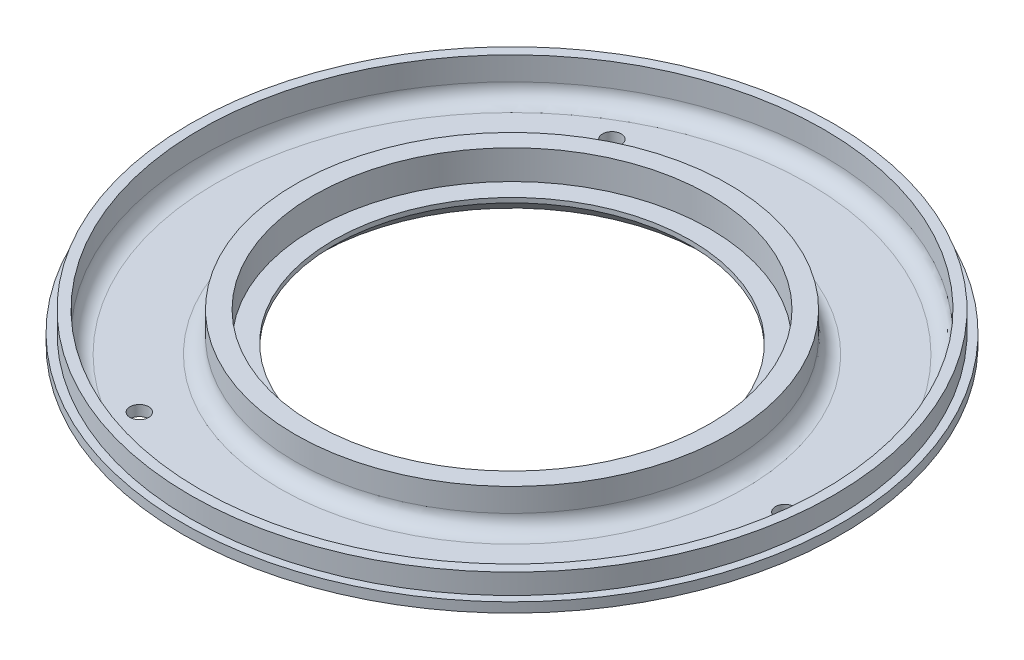
ISO-10303-21;
HEADER;
FILE_DESCRIPTION(('STEP AP214'),'2;1');
FILE_NAME('part.step','',(''),(''),'','','');
FILE_SCHEMA(('AUTOMOTIVE_DESIGN { 1 0 10303 214 1 1 1 1 }'));
ENDSEC;
DATA;
#1=APPLICATION_CONTEXT('core data for automotive mechanical design processes');
#2=APPLICATION_PROTOCOL_DEFINITION('international standard','automotive_design',2000,#1);
#3=PRODUCT_CONTEXT('',#1,'mechanical');
#4=PRODUCT('Part','Part','',(#3));
#5=PRODUCT_RELATED_PRODUCT_CATEGORY('part','',(#4));
#6=PRODUCT_DEFINITION_FORMATION('','',#4);
#7=PRODUCT_DEFINITION_CONTEXT('part definition',#1,'design');
#8=PRODUCT_DEFINITION('design','',#6,#7);
#9=PRODUCT_DEFINITION_SHAPE('','',#8);
#10=(LENGTH_UNIT() NAMED_UNIT(*) SI_UNIT(.MILLI.,.METRE.));
#11=(NAMED_UNIT(*) PLANE_ANGLE_UNIT() SI_UNIT($,.RADIAN.));
#12=(NAMED_UNIT(*) SI_UNIT($,.STERADIAN.) SOLID_ANGLE_UNIT());
#13=UNCERTAINTY_MEASURE_WITH_UNIT(LENGTH_MEASURE(1.E-05),#10,'distance_accuracy_value','');
#14=(GEOMETRIC_REPRESENTATION_CONTEXT(3) GLOBAL_UNCERTAINTY_ASSIGNED_CONTEXT((#13)) GLOBAL_UNIT_ASSIGNED_CONTEXT((#10,
#11,#12)) REPRESENTATION_CONTEXT('',''));
#15=CARTESIAN_POINT('',(0.,0.,0.));
#16=DIRECTION('',(0.,0.,1.));
#17=DIRECTION('',(1.,0.,0.));
#18=AXIS2_PLACEMENT_3D('',#15,#16,#17);
#19=CARTESIAN_POINT('',(0.,-0.634999999999997,0.));
#20=DIRECTION('',(0.,-1.,0.));
#21=DIRECTION('',(0.,0.,-1.));
#22=AXIS2_PLACEMENT_3D('',#19,#20,#21);
#23=CYLINDRICAL_SURFACE('',#22,82.55);
#24=CARTESIAN_POINT('',(0.,12.7,0.));
#25=DIRECTION('',(0.,-1.,0.));
#26=DIRECTION('',(0.,0.,-1.));
#27=AXIS2_PLACEMENT_3D('',#24,#25,#26);
#28=CIRCLE('',#27,82.55);
#29=CARTESIAN_POINT('',(0.,12.7,-82.55));
#30=VERTEX_POINT('',#29);
#31=EDGE_CURVE('E91',#30,#30,#28,.T.);
#32=ORIENTED_EDGE('',*,*,#31,.T.);
#33=EDGE_LOOP('',(#32));
#34=FACE_BOUND('',#33,.T.);
#35=CARTESIAN_POINT('',(0.,7.50000000000001,0.));
#36=DIRECTION('',(0.,-1.,0.));
#37=DIRECTION('',(0.,0.,-1.));
#38=AXIS2_PLACEMENT_3D('',#35,#36,#37);
#39=CIRCLE('',#38,82.55);
#40=CARTESIAN_POINT('',(0.,7.50000000000001,-82.55));
#41=VERTEX_POINT('',#40);
#42=EDGE_CURVE('E121',#41,#41,#39,.T.);
#43=ORIENTED_EDGE('',*,*,#42,.F.);
#44=EDGE_LOOP('',(#43));
#45=FACE_BOUND('',#44,.T.);
#46=ADVANCED_FACE('F47',(#34,#45),#23,.T.);
#47=CARTESIAN_POINT('',(0.,12.7,82.55));
#48=DIRECTION('',(0.,-1.,0.));
#49=DIRECTION('',(0.,0.,-1.));
#50=AXIS2_PLACEMENT_3D('',#47,#48,#49);
#51=PLANE('',#50);
#52=CARTESIAN_POINT('',(0.,12.7,0.));
#53=DIRECTION('',(0.,-1.,0.));
#54=DIRECTION('',(0.,0.,-1.));
#55=AXIS2_PLACEMENT_3D('',#52,#53,#54);
#56=CIRCLE('',#55,50.8);
#57=CARTESIAN_POINT('',(0.,12.7,-50.8));
#58=VERTEX_POINT('',#57);
#59=EDGE_CURVE('E94',#58,#58,#56,.T.);
#60=ORIENTED_EDGE('',*,*,#59,.T.);
#61=EDGE_LOOP('',(#60));
#62=FACE_BOUND('',#61,.T.);
#63=CARTESIAN_POINT('',(0.,12.7,0.));
#64=DIRECTION('',(0.,1.,0.));
#65=DIRECTION('',(0.,0.,1.));
#66=AXIS2_PLACEMENT_3D('',#63,#64,#65);
#67=CIRCLE('',#66,55.626);
#68=CARTESIAN_POINT('',(0.,12.7,55.626));
#69=VERTEX_POINT('',#68);
#70=EDGE_CURVE('E85',#69,#69,#67,.T.);
#71=ORIENTED_EDGE('',*,*,#70,.T.);
#72=EDGE_LOOP('',(#71));
#73=FACE_BOUND('',#72,.T.);
#74=ADVANCED_FACE('F142',(#62,#73),#51,.F.);
#75=CARTESIAN_POINT('',(0.,-0.634999999999997,0.));
#76=DIRECTION('',(0.,-1.,0.));
#77=DIRECTION('',(0.,0.,-1.));
#78=AXIS2_PLACEMENT_3D('',#75,#76,#77);
#79=CYLINDRICAL_SURFACE('',#78,45.8);
#80=CARTESIAN_POINT('',(0.,4.,0.));
#81=DIRECTION('',(0.,1.,0.));
#82=DIRECTION('',(0.,0.,1.));
#83=AXIS2_PLACEMENT_3D('',#80,#81,#82);
#84=CIRCLE('',#83,45.8);
#85=CARTESIAN_POINT('',(0.,4.,45.8));
#86=VERTEX_POINT('',#85);
#87=EDGE_CURVE('E115',#86,#86,#84,.F.);
#88=ORIENTED_EDGE('',*,*,#87,.T.);
#89=EDGE_LOOP('',(#88));
#90=FACE_BOUND('',#89,.T.);
#91=CARTESIAN_POINT('',(0.,5.19999999999998,0.));
#92=DIRECTION('',(0.,-1.,0.));
#93=DIRECTION('',(0.,0.,-1.));
#94=AXIS2_PLACEMENT_3D('',#91,#92,#93);
#95=CIRCLE('',#94,45.8);
#96=CARTESIAN_POINT('',(0.,5.19999999999998,-45.8));
#97=VERTEX_POINT('',#96);
#98=EDGE_CURVE('E100',#97,#97,#95,.T.);
#99=ORIENTED_EDGE('',*,*,#98,.F.);
#100=EDGE_LOOP('',(#99));
#101=FACE_BOUND('',#100,.T.);
#102=ADVANCED_FACE('F148',(#90,#101),#79,.F.);
#103=CARTESIAN_POINT('',(0.,5.19999999999998,45.8));
#104=DIRECTION('',(0.,-1.,0.));
#105=DIRECTION('',(0.,0.,-1.));
#106=AXIS2_PLACEMENT_3D('',#103,#104,#105);
#107=PLANE('',#106);
#108=CARTESIAN_POINT('',(0.,5.19999999999998,0.));
#109=DIRECTION('',(0.,-1.,0.));
#110=DIRECTION('',(0.,0.,-1.));
#111=AXIS2_PLACEMENT_3D('',#108,#109,#110);
#112=CIRCLE('',#111,50.8);
#113=CARTESIAN_POINT('',(0.,5.19999999999998,-50.8));
#114=VERTEX_POINT('',#113);
#115=EDGE_CURVE('E97',#114,#114,#112,.T.);
#116=ORIENTED_EDGE('',*,*,#115,.F.);
#117=EDGE_LOOP('',(#116));
#118=FACE_BOUND('',#117,.T.);
#119=ORIENTED_EDGE('',*,*,#98,.T.);
#120=EDGE_LOOP('',(#119));
#121=FACE_BOUND('',#120,.T.);
#122=ADVANCED_FACE('F162',(#118,#121),#107,.F.);
#123=CARTESIAN_POINT('',(0.,-0.634999999999997,0.));
#124=DIRECTION('',(0.,-1.,0.));
#125=DIRECTION('',(0.,0.,-1.));
#126=AXIS2_PLACEMENT_3D('',#123,#124,#125);
#127=CYLINDRICAL_SURFACE('',#126,50.8);
#128=ORIENTED_EDGE('',*,*,#59,.F.);
#129=EDGE_LOOP('',(#128));
#130=FACE_BOUND('',#129,.T.);
#131=ORIENTED_EDGE('',*,*,#115,.T.);
#132=EDGE_LOOP('',(#131));
#133=FACE_BOUND('',#132,.T.);
#134=ADVANCED_FACE('F158',(#130,#133),#127,.F.);
#135=CARTESIAN_POINT('',(0.,12.7,0.));
#136=DIRECTION('',(0.,1.,0.));
#137=DIRECTION('',(0.,0.,1.));
#138=AXIS2_PLACEMENT_3D('',#135,#136,#137);
#139=CIRCLE('',#138,80.01);
#140=CARTESIAN_POINT('',(0.,12.7,80.01));
#141=VERTEX_POINT('',#140);
#142=EDGE_CURVE('E88',#141,#141,#139,.T.);
#143=ORIENTED_EDGE('',*,*,#142,.F.);
#144=EDGE_LOOP('',(#143));
#145=FACE_BOUND('',#144,.T.);
#146=ORIENTED_EDGE('',*,*,#31,.F.);
#147=EDGE_LOOP('',(#146));
#148=FACE_BOUND('',#147,.T.);
#149=ADVANCED_FACE('F151',(#145,#148),#51,.F.);
#150=CARTESIAN_POINT('',(0.,0.,45.8));
#151=DIRECTION('',(0.,1.,0.));
#152=DIRECTION('',(0.,0.,1.));
#153=AXIS2_PLACEMENT_3D('',#150,#151,#152);
#154=PLANE('',#153);
#155=CARTESIAN_POINT('',(70.,0.,-7.48971031235348E-13));
#156=DIRECTION('',(0.,-1.,0.));
#157=DIRECTION('',(0.,0.,-1.));
#158=AXIS2_PLACEMENT_3D('',#155,#156,#157);
#159=CIRCLE('',#158,2.40029999999999);
#160=CARTESIAN_POINT('',(70.,0.,-2.40030000000074));
#161=VERTEX_POINT('',#160);
#162=EDGE_CURVE('E80',#161,#161,#159,.T.);
#163=ORIENTED_EDGE('',*,*,#162,.F.);
#164=EDGE_LOOP('',(#163));
#165=FACE_BOUND('',#164,.T.);
#166=CARTESIAN_POINT('',(-34.9999999999997,0.,60.621778264911));
#167=DIRECTION('',(0.,-1.,0.));
#168=DIRECTION('',(0.,0.,-1.));
#169=AXIS2_PLACEMENT_3D('',#166,#167,#168);
#170=CIRCLE('',#169,2.4003);
#171=CARTESIAN_POINT('',(-34.9999999999997,0.,58.221478264911));
#172=VERTEX_POINT('',#171);
#173=EDGE_CURVE('E70',#172,#172,#170,.T.);
#174=ORIENTED_EDGE('',*,*,#173,.F.);
#175=EDGE_LOOP('',(#174));
#176=FACE_BOUND('',#175,.T.);
#177=CARTESIAN_POINT('',(-35.0000000000001,0.,-60.6217782649107));
#178=DIRECTION('',(0.,-1.,0.));
#179=DIRECTION('',(0.,0.,-1.));
#180=AXIS2_PLACEMENT_3D('',#177,#178,#179);
#181=CIRCLE('',#180,2.4003);
#182=CARTESIAN_POINT('',(-35.0000000000001,0.,-63.0220782649107));
#183=VERTEX_POINT('',#182);
#184=EDGE_CURVE('E67',#183,#183,#181,.T.);
#185=ORIENTED_EDGE('',*,*,#184,.F.);
#186=EDGE_LOOP('',(#185));
#187=FACE_BOUND('',#186,.T.);
#188=CARTESIAN_POINT('',(0.,0.,0.));
#189=DIRECTION('',(0.,1.,0.));
#190=DIRECTION('',(0.,0.,1.));
#191=AXIS2_PLACEMENT_3D('',#188,#189,#190);
#192=CIRCLE('',#191,74.55);
#193=CARTESIAN_POINT('',(0.,0.,74.5500000000001));
#194=VERTEX_POINT('',#193);
#195=EDGE_CURVE('E55',#194,#194,#192,.F.);
#196=ORIENTED_EDGE('',*,*,#195,.T.);
#197=EDGE_LOOP('',(#196));
#198=FACE_BOUND('',#197,.T.);
#199=CARTESIAN_POINT('',(0.,0.,0.));
#200=DIRECTION('',(0.,1.,0.));
#201=DIRECTION('',(0.,0.,1.));
#202=AXIS2_PLACEMENT_3D('',#199,#200,#201);
#203=CIRCLE('',#202,49.8);
#204=CARTESIAN_POINT('',(0.,0.,49.8));
#205=VERTEX_POINT('',#204);
#206=EDGE_CURVE('E118',#205,#205,#203,.T.);
#207=ORIENTED_EDGE('',*,*,#206,.T.);
#208=EDGE_LOOP('',(#207));
#209=FACE_BOUND('',#208,.T.);
#210=ADVANCED_FACE('F154',(#165,#176,#187,#198,#209),#154,.F.);
#211=CARTESIAN_POINT('',(0.,2.69999999999998,0.));
#212=DIRECTION('',(0.,1.,0.));
#213=DIRECTION('',(0.,0.,1.));
#214=AXIS2_PLACEMENT_3D('',#211,#212,#213);
#215=PLANE('',#214);
#216=CARTESIAN_POINT('',(70.,2.69999999999998,-7.48787177213649E-13));
#217=DIRECTION('',(0.,1.,0.));
#218=DIRECTION('',(0.,0.,1.));
#219=AXIS2_PLACEMENT_3D('',#216,#217,#218);
#220=CIRCLE('',#219,2.40029999999999);
#221=CARTESIAN_POINT('',(70.,2.69999999999998,2.40029999999925));
#222=VERTEX_POINT('',#221);
#223=EDGE_CURVE('E51',#222,#222,#220,.T.);
#224=ORIENTED_EDGE('',*,*,#223,.F.);
#225=EDGE_LOOP('',(#224));
#226=FACE_BOUND('',#225,.T.);
#227=CARTESIAN_POINT('',(-34.9999999999997,2.69999999999998,60.621778264911));
#228=DIRECTION('',(0.,1.,0.));
#229=DIRECTION('',(0.,0.,1.));
#230=AXIS2_PLACEMENT_3D('',#227,#228,#229);
#231=CIRCLE('',#230,2.4003);
#232=CARTESIAN_POINT('',(-34.9999999999997,2.69999999999998,63.022078264911));
#233=VERTEX_POINT('',#232);
#234=EDGE_CURVE('E68',#233,#233,#231,.T.);
#235=ORIENTED_EDGE('',*,*,#234,.F.);
#236=EDGE_LOOP('',(#235));
#237=FACE_BOUND('',#236,.T.);
#238=CARTESIAN_POINT('',(-35.0000000000001,2.69999999999998,-60.6217782649107));
#239=DIRECTION('',(0.,1.,0.));
#240=DIRECTION('',(0.,0.,1.));
#241=AXIS2_PLACEMENT_3D('',#238,#239,#240);
#242=CIRCLE('',#241,2.4003);
#243=CARTESIAN_POINT('',(-35.0000000000001,2.69999999999998,-58.2214782649107));
#244=VERTEX_POINT('',#243);
#245=EDGE_CURVE('E64',#244,#244,#242,.T.);
#246=ORIENTED_EDGE('',*,*,#245,.F.);
#247=EDGE_LOOP('',(#246));
#248=FACE_BOUND('',#247,.T.);
#249=CARTESIAN_POINT('',(0.,2.69999999999998,0.));
#250=DIRECTION('',(0.,1.,0.));
#251=DIRECTION('',(0.,0.,1.));
#252=AXIS2_PLACEMENT_3D('',#249,#250,#251);
#253=CIRCLE('',#252,59.626);
#254=CARTESIAN_POINT('',(0.,2.69999999999998,59.626));
#255=VERTEX_POINT('',#254);
#256=EDGE_CURVE('E109',#255,#255,#253,.F.);
#257=ORIENTED_EDGE('',*,*,#256,.T.);
#258=EDGE_LOOP('',(#257));
#259=FACE_BOUND('',#258,.T.);
#260=CARTESIAN_POINT('',(0.,2.69999999999998,0.));
#261=DIRECTION('',(0.,1.,0.));
#262=DIRECTION('',(0.,0.,1.));
#263=AXIS2_PLACEMENT_3D('',#260,#261,#262);
#264=CIRCLE('',#263,76.01);
#265=CARTESIAN_POINT('',(0.,2.69999999999998,76.01));
#266=VERTEX_POINT('',#265);
#267=EDGE_CURVE('E106',#266,#266,#264,.T.);
#268=ORIENTED_EDGE('',*,*,#267,.T.);
#269=EDGE_LOOP('',(#268));
#270=FACE_BOUND('',#269,.T.);
#271=ADVANCED_FACE('F193',(#226,#237,#248,#259,#270),#215,.T.);
#272=CARTESIAN_POINT('',(0.,2.69999999999998,0.));
#273=DIRECTION('',(0.,1.,0.));
#274=DIRECTION('',(0.,0.,1.));
#275=AXIS2_PLACEMENT_3D('',#272,#273,#274);
#276=CYLINDRICAL_SURFACE('',#275,80.01);
#277=CARTESIAN_POINT('',(0.,6.69999999999998,0.));
#278=DIRECTION('',(0.,1.,0.));
#279=DIRECTION('',(0.,0.,1.));
#280=AXIS2_PLACEMENT_3D('',#277,#278,#279);
#281=CIRCLE('',#280,80.01);
#282=CARTESIAN_POINT('',(0.,6.69999999999998,80.01));
#283=VERTEX_POINT('',#282);
#284=EDGE_CURVE('E112',#283,#283,#281,.F.);
#285=ORIENTED_EDGE('',*,*,#284,.T.);
#286=EDGE_LOOP('',(#285));
#287=FACE_BOUND('',#286,.T.);
#288=ORIENTED_EDGE('',*,*,#142,.T.);
#289=EDGE_LOOP('',(#288));
#290=FACE_BOUND('',#289,.T.);
#291=ADVANCED_FACE('F198',(#287,#290),#276,.F.);
#292=CARTESIAN_POINT('',(0.,2.69999999999998,0.));
#293=DIRECTION('',(0.,1.,0.));
#294=DIRECTION('',(0.,0.,1.));
#295=AXIS2_PLACEMENT_3D('',#292,#293,#294);
#296=CYLINDRICAL_SURFACE('',#295,55.626);
#297=CARTESIAN_POINT('',(0.,6.69999999999998,0.));
#298=DIRECTION('',(0.,1.,0.));
#299=DIRECTION('',(0.,0.,1.));
#300=AXIS2_PLACEMENT_3D('',#297,#298,#299);
#301=CIRCLE('',#300,55.626);
#302=CARTESIAN_POINT('',(0.,6.69999999999998,55.626));
#303=VERTEX_POINT('',#302);
#304=EDGE_CURVE('E103',#303,#303,#301,.T.);
#305=ORIENTED_EDGE('',*,*,#304,.T.);
#306=EDGE_LOOP('',(#305));
#307=FACE_BOUND('',#306,.T.);
#308=ORIENTED_EDGE('',*,*,#70,.F.);
#309=EDGE_LOOP('',(#308));
#310=FACE_BOUND('',#309,.T.);
#311=ADVANCED_FACE('F174',(#307,#310),#296,.T.);
#312=CARTESIAN_POINT('',(0.,6.69999999999998,0.));
#313=DIRECTION('',(0.,1.,0.));
#314=DIRECTION('',(0.,0.,1.));
#315=AXIS2_PLACEMENT_3D('',#312,#313,#314);
#316=TOROIDAL_SURFACE('',#315,59.626,4.);
#317=ORIENTED_EDGE('',*,*,#256,.F.);
#318=EDGE_LOOP('',(#317));
#319=FACE_BOUND('',#318,.T.);
#320=ORIENTED_EDGE('',*,*,#304,.F.);
#321=EDGE_LOOP('',(#320));
#322=FACE_BOUND('',#321,.T.);
#323=ADVANCED_FACE('F170',(#319,#322),#316,.F.);
#324=CARTESIAN_POINT('',(0.,6.69999999999998,0.));
#325=DIRECTION('',(0.,1.,0.));
#326=DIRECTION('',(0.,0.,1.));
#327=AXIS2_PLACEMENT_3D('',#324,#325,#326);
#328=TOROIDAL_SURFACE('',#327,76.01,4.);
#329=ORIENTED_EDGE('',*,*,#284,.F.);
#330=EDGE_LOOP('',(#329));
#331=FACE_BOUND('',#330,.T.);
#332=ORIENTED_EDGE('',*,*,#267,.F.);
#333=EDGE_LOOP('',(#332));
#334=FACE_BOUND('',#333,.T.);
#335=ADVANCED_FACE('F173',(#331,#334),#328,.F.);
#336=CARTESIAN_POINT('',(0.,4.,0.));
#337=DIRECTION('',(0.,-1.,0.));
#338=DIRECTION('',(0.,0.,-1.));
#339=AXIS2_PLACEMENT_3D('',#336,#337,#338);
#340=CONICAL_SURFACE('',#339,45.8,0.785398163397449);
#341=ORIENTED_EDGE('',*,*,#206,.F.);
#342=EDGE_LOOP('',(#341));
#343=FACE_BOUND('',#342,.T.);
#344=ORIENTED_EDGE('',*,*,#87,.F.);
#345=EDGE_LOOP('',(#344));
#346=FACE_BOUND('',#345,.T.);
#347=ADVANCED_FACE('F177',(#343,#346),#340,.F.);
#348=CARTESIAN_POINT('',(0.,7.50000000000001,0.));
#349=DIRECTION('',(0.,-1.,0.));
#350=DIRECTION('',(0.,0.,-1.));
#351=AXIS2_PLACEMENT_3D('',#348,#349,#350);
#352=CYLINDRICAL_SURFACE('',#351,84.55);
#353=CARTESIAN_POINT('',(0.,5.,0.));
#354=DIRECTION('',(0.,1.,0.));
#355=DIRECTION('',(0.,0.,1.));
#356=AXIS2_PLACEMENT_3D('',#353,#354,#355);
#357=CIRCLE('',#356,84.55);
#358=CARTESIAN_POINT('',(0.,5.,84.55));
#359=VERTEX_POINT('',#358);
#360=EDGE_CURVE('E60',#359,#359,#357,.T.);
#361=ORIENTED_EDGE('',*,*,#360,.T.);
#362=EDGE_LOOP('',(#361));
#363=FACE_BOUND('',#362,.T.);
#364=CARTESIAN_POINT('',(0.,7.50000000000001,0.));
#365=DIRECTION('',(0.,-1.,0.));
#366=DIRECTION('',(0.,0.,-1.));
#367=AXIS2_PLACEMENT_3D('',#364,#365,#366);
#368=CIRCLE('',#367,84.55);
#369=CARTESIAN_POINT('',(0.,7.50000000000001,-84.55));
#370=VERTEX_POINT('',#369);
#371=EDGE_CURVE('E66',#370,#370,#368,.T.);
#372=ORIENTED_EDGE('',*,*,#371,.T.);
#373=EDGE_LOOP('',(#372));
#374=FACE_BOUND('',#373,.T.);
#375=ADVANCED_FACE('F126',(#363,#374),#352,.T.);
#376=CARTESIAN_POINT('',(0.,7.50000000000001,0.));
#377=DIRECTION('',(0.,-1.,0.));
#378=DIRECTION('',(0.,0.,-1.));
#379=AXIS2_PLACEMENT_3D('',#376,#377,#378);
#380=PLANE('',#379);
#381=ORIENTED_EDGE('',*,*,#42,.T.);
#382=EDGE_LOOP('',(#381));
#383=FACE_BOUND('',#382,.T.);
#384=ORIENTED_EDGE('',*,*,#371,.F.);
#385=EDGE_LOOP('',(#384));
#386=FACE_BOUND('',#385,.T.);
#387=ADVANCED_FACE('F131',(#383,#386),#380,.F.);
#388=CARTESIAN_POINT('',(0.,0.,0.));
#389=DIRECTION('',(0.,1.,0.));
#390=DIRECTION('',(0.,0.,1.));
#391=AXIS2_PLACEMENT_3D('',#388,#389,#390);
#392=CONICAL_SURFACE('',#391,75.8897459621557,1.04719755119659);
#393=CARTESIAN_POINT('',(0.,0.66987298107779,0.));
#394=DIRECTION('',(0.,1.,0.));
#395=DIRECTION('',(0.,0.,1.));
#396=AXIS2_PLACEMENT_3D('',#393,#394,#395);
#397=CIRCLE('',#396,77.0500000000001);
#398=CARTESIAN_POINT('',(0.,0.66987298107779,77.0500000000001));
#399=VERTEX_POINT('',#398);
#400=EDGE_CURVE('E12',#399,#399,#397,.T.);
#401=ORIENTED_EDGE('',*,*,#400,.T.);
#402=EDGE_LOOP('',(#401));
#403=FACE_BOUND('',#402,.T.);
#404=ORIENTED_EDGE('',*,*,#360,.F.);
#405=EDGE_LOOP('',(#404));
#406=FACE_BOUND('',#405,.T.);
#407=ADVANCED_FACE('F129',(#403,#406),#392,.T.);
#408=CARTESIAN_POINT('',(0.,5.,0.));
#409=DIRECTION('',(0.,1.,0.));
#410=DIRECTION('',(0.,0.,1.));
#411=AXIS2_PLACEMENT_3D('',#408,#409,#410);
#412=TOROIDAL_SURFACE('',#411,74.55,5.);
#413=ORIENTED_EDGE('',*,*,#400,.F.);
#414=EDGE_LOOP('',(#413));
#415=FACE_BOUND('',#414,.T.);
#416=ORIENTED_EDGE('',*,*,#195,.F.);
#417=EDGE_LOOP('',(#416));
#418=FACE_BOUND('',#417,.T.);
#419=ADVANCED_FACE('F49',(#415,#418),#412,.T.);
#420=CARTESIAN_POINT('',(-35.0000000000001,0.,-60.6217782649107));
#421=DIRECTION('',(0.,-1.,0.));
#422=DIRECTION('',(0.,0.,-1.));
#423=AXIS2_PLACEMENT_3D('',#420,#421,#422);
#424=CYLINDRICAL_SURFACE('',#423,2.4003);
#425=ORIENTED_EDGE('',*,*,#245,.T.);
#426=EDGE_LOOP('',(#425));
#427=FACE_BOUND('',#426,.T.);
#428=ORIENTED_EDGE('',*,*,#184,.T.);
#429=EDGE_LOOP('',(#428));
#430=FACE_BOUND('',#429,.T.);
#431=ADVANCED_FACE('F136',(#427,#430),#424,.F.);
#432=CARTESIAN_POINT('',(-34.9999999999997,0.,60.621778264911));
#433=DIRECTION('',(0.,-1.,0.));
#434=DIRECTION('',(0.,0.,-1.));
#435=AXIS2_PLACEMENT_3D('',#432,#433,#434);
#436=CYLINDRICAL_SURFACE('',#435,2.4003);
#437=ORIENTED_EDGE('',*,*,#234,.T.);
#438=EDGE_LOOP('',(#437));
#439=FACE_BOUND('',#438,.T.);
#440=ORIENTED_EDGE('',*,*,#173,.T.);
#441=EDGE_LOOP('',(#440));
#442=FACE_BOUND('',#441,.T.);
#443=ADVANCED_FACE('F211',(#439,#442),#436,.F.);
#444=CARTESIAN_POINT('',(70.,0.,-7.48971031235348E-13));
#445=DIRECTION('',(0.,-1.,0.));
#446=DIRECTION('',(0.,0.,-1.));
#447=AXIS2_PLACEMENT_3D('',#444,#445,#446);
#448=CYLINDRICAL_SURFACE('',#447,2.40029999999999);
#449=ORIENTED_EDGE('',*,*,#223,.T.);
#450=EDGE_LOOP('',(#449));
#451=FACE_BOUND('',#450,.T.);
#452=ORIENTED_EDGE('',*,*,#162,.T.);
#453=EDGE_LOOP('',(#452));
#454=FACE_BOUND('',#453,.T.);
#455=ADVANCED_FACE('F217',(#451,#454),#448,.F.);
#456=CLOSED_SHELL('',(#46,#74,#102,#122,#134,#149,#210,#271,#291,#311,#323,#335,#347,#375,#387,
#407,#419,#431,#443,#455));
#457=MANIFOLD_SOLID_BREP('B2',#456);
#458=ADVANCED_BREP_SHAPE_REPRESENTATION('',(#18,#457),#14);
#459=SHAPE_DEFINITION_REPRESENTATION(#9,#458);
ENDSEC;
END-ISO-10303-21;
